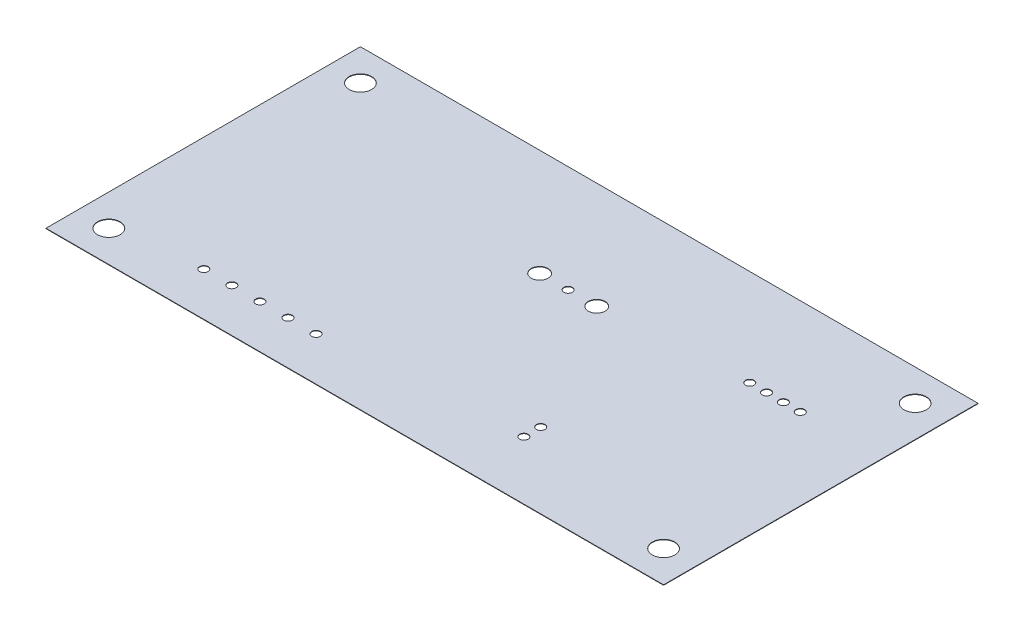
ISO-10303-21;
HEADER;
FILE_DESCRIPTION(('STEP AP214'),'2;1');
FILE_NAME('part.step','',(''),(''),'','','');
FILE_SCHEMA(('AUTOMOTIVE_DESIGN { 1 0 10303 214 1 1 1 1 }'));
ENDSEC;
DATA;
#1=APPLICATION_CONTEXT('core data for automotive mechanical design processes');
#2=APPLICATION_PROTOCOL_DEFINITION('international standard','automotive_design',2000,#1);
#3=PRODUCT_CONTEXT('',#1,'mechanical');
#4=PRODUCT('Part','Part','',(#3));
#5=PRODUCT_RELATED_PRODUCT_CATEGORY('part','',(#4));
#6=PRODUCT_DEFINITION_FORMATION('','',#4);
#7=PRODUCT_DEFINITION_CONTEXT('part definition',#1,'design');
#8=PRODUCT_DEFINITION('design','',#6,#7);
#9=PRODUCT_DEFINITION_SHAPE('','',#8);
#10=(LENGTH_UNIT() NAMED_UNIT(*) SI_UNIT(.MILLI.,.METRE.));
#11=(NAMED_UNIT(*) PLANE_ANGLE_UNIT() SI_UNIT($,.RADIAN.));
#12=(NAMED_UNIT(*) SI_UNIT($,.STERADIAN.) SOLID_ANGLE_UNIT());
#13=UNCERTAINTY_MEASURE_WITH_UNIT(LENGTH_MEASURE(1.E-05),#10,'distance_accuracy_value','');
#14=(GEOMETRIC_REPRESENTATION_CONTEXT(3) GLOBAL_UNCERTAINTY_ASSIGNED_CONTEXT((#13)) GLOBAL_UNIT_ASSIGNED_CONTEXT((#10,
#11,#12)) REPRESENTATION_CONTEXT('',''));
#15=CARTESIAN_POINT('',(0.,0.,0.));
#16=DIRECTION('',(0.,0.,1.));
#17=DIRECTION('',(1.,0.,0.));
#18=AXIS2_PLACEMENT_3D('',#15,#16,#17);
#19=CARTESIAN_POINT('',(0.,1.,0.));
#20=DIRECTION('',(0.,1.,0.));
#21=DIRECTION('',(0.,0.,1.));
#22=AXIS2_PLACEMENT_3D('',#19,#20,#21);
#23=PLANE('',#22);
#24=CARTESIAN_POINT('',(449.0212,1.,-98.4503999999998));
#25=DIRECTION('',(0.,1.,0.));
#26=DIRECTION('',(0.,0.,1.));
#27=AXIS2_PLACEMENT_3D('',#24,#25,#26);
#28=CIRCLE('',#27,9.67739999999995);
#29=CARTESIAN_POINT('',(449.0212,1.,-88.7729999999999));
#30=VERTEX_POINT('',#29);
#31=EDGE_CURVE('E205',#30,#30,#28,.T.);
#32=ORIENTED_EDGE('',*,*,#31,.F.);
#33=EDGE_LOOP('',(#32));
#34=FACE_BOUND('',#33,.T.);
#35=CARTESIAN_POINT('',(322.0212,1.,-98.4503999999998));
#36=DIRECTION('',(0.,1.,0.));
#37=DIRECTION('',(0.,0.,1.));
#38=AXIS2_PLACEMENT_3D('',#35,#36,#37);
#39=CIRCLE('',#38,9.6774);
#40=CARTESIAN_POINT('',(322.0212,1.,-88.7729999999998));
#41=VERTEX_POINT('',#40);
#42=EDGE_CURVE('E193',#41,#41,#39,.T.);
#43=ORIENTED_EDGE('',*,*,#42,.F.);
#44=EDGE_LOOP('',(#43));
#45=FACE_BOUND('',#44,.T.);
#46=CARTESIAN_POINT('',(775.716,1.,-469.9));
#47=DIRECTION('',(0.,1.,0.));
#48=DIRECTION('',(0.,0.,1.));
#49=AXIS2_PLACEMENT_3D('',#46,#47,#48);
#50=CIRCLE('',#49,19.05);
#51=CARTESIAN_POINT('',(775.716,1.,-450.85));
#52=VERTEX_POINT('',#51);
#53=EDGE_CURVE('E181',#52,#52,#50,.T.);
#54=ORIENTED_EDGE('',*,*,#53,.F.);
#55=EDGE_LOOP('',(#54));
#56=FACE_BOUND('',#55,.T.);
#57=CARTESIAN_POINT('',(1325.88,1.,-640.08));
#58=DIRECTION('',(0.,1.,0.));
#59=DIRECTION('',(0.,0.,1.));
#60=AXIS2_PLACEMENT_3D('',#57,#58,#59);
#61=CIRCLE('',#60,25.4000000000001);
#62=CARTESIAN_POINT('',(1325.88,1.,-614.68));
#63=VERTEX_POINT('',#62);
#64=EDGE_CURVE('E169',#63,#63,#61,.T.);
#65=ORIENTED_EDGE('',*,*,#64,.F.);
#66=EDGE_LOOP('',(#65));
#67=FACE_BOUND('',#66,.T.);
#68=CARTESIAN_POINT('',(71.1199999999999,1.,-71.1199999999998));
#69=DIRECTION('',(0.,1.,0.));
#70=DIRECTION('',(0.,0.,1.));
#71=AXIS2_PLACEMENT_3D('',#68,#69,#70);
#72=CIRCLE('',#71,25.4);
#73=CARTESIAN_POINT('',(71.1199999999999,1.,-45.7199999999998));
#74=VERTEX_POINT('',#73);
#75=EDGE_CURVE('E157',#74,#74,#72,.T.);
#76=ORIENTED_EDGE('',*,*,#75,.F.);
#77=EDGE_LOOP('',(#76));
#78=FACE_BOUND('',#77,.T.);
#79=CARTESIAN_POINT('',(711.2,1.,-469.9));
#80=DIRECTION('',(0.,1.,0.));
#81=DIRECTION('',(0.,0.,1.));
#82=AXIS2_PLACEMENT_3D('',#79,#80,#81);
#83=CIRCLE('',#82,9.67739999999995);
#84=CARTESIAN_POINT('',(711.2,1.,-460.2226));
#85=VERTEX_POINT('',#84);
#86=EDGE_CURVE('E145',#85,#85,#83,.T.);
#87=ORIENTED_EDGE('',*,*,#86,.F.);
#88=EDGE_LOOP('',(#87));
#89=FACE_BOUND('',#88,.T.);
#90=CARTESIAN_POINT('',(948.8424,1.,-170.2308));
#91=DIRECTION('',(0.,1.,0.));
#92=DIRECTION('',(0.,0.,1.));
#93=AXIS2_PLACEMENT_3D('',#90,#91,#92);
#94=CIRCLE('',#93,9.67739999999995);
#95=CARTESIAN_POINT('',(948.8424,1.,-160.5534));
#96=VERTEX_POINT('',#95);
#97=EDGE_CURVE('E133',#96,#96,#94,.T.);
#98=ORIENTED_EDGE('',*,*,#97,.F.);
#99=EDGE_LOOP('',(#98));
#100=FACE_BOUND('',#99,.T.);
#101=CARTESIAN_POINT('',(1174.8516,1.,-493.2172));
#102=DIRECTION('',(0.,1.,0.));
#103=DIRECTION('',(0.,0.,1.));
#104=AXIS2_PLACEMENT_3D('',#101,#102,#103);
#105=CIRCLE('',#104,9.67739999999995);
#106=CARTESIAN_POINT('',(1174.8516,1.,-483.5398));
#107=VERTEX_POINT('',#106);
#108=EDGE_CURVE('E121',#107,#107,#105,.T.);
#109=ORIENTED_EDGE('',*,*,#108,.F.);
#110=EDGE_LOOP('',(#109));
#111=FACE_BOUND('',#110,.T.);
#112=CARTESIAN_POINT('',(1098.6516,1.,-493.2172));
#113=DIRECTION('',(0.,1.,0.));
#114=DIRECTION('',(0.,0.,1.));
#115=AXIS2_PLACEMENT_3D('',#112,#113,#114);
#116=CIRCLE('',#115,9.67739999999995);
#117=CARTESIAN_POINT('',(1098.6516,1.,-483.5398));
#118=VERTEX_POINT('',#117);
#119=EDGE_CURVE('E100',#118,#118,#116,.T.);
#120=ORIENTED_EDGE('',*,*,#119,.F.);
#121=EDGE_LOOP('',(#120));
#122=FACE_BOUND('',#121,.T.);
#123=DIRECTION('',(0.,0.,-1.));
#124=VECTOR('',#123,1.);
#125=CARTESIAN_POINT('',(1397.,1.,1.11022302462516E-13));
#126=LINE('',#125,#124);
#127=CARTESIAN_POINT('',(1397.,1.,1.11022302462516E-13));
#128=VERTEX_POINT('',#127);
#129=CARTESIAN_POINT('',(1397.,1.,-711.2));
#130=VERTEX_POINT('',#129);
#131=EDGE_CURVE('E85',#128,#130,#126,.T.);
#132=ORIENTED_EDGE('',*,*,#131,.T.);
#133=DIRECTION('',(-1.,0.,0.));
#134=VECTOR('',#133,1.);
#135=CARTESIAN_POINT('',(1397.,1.,-711.2));
#136=LINE('',#135,#134);
#137=CARTESIAN_POINT('',(-1.04083408558608E-13,1.,-711.2));
#138=VERTEX_POINT('',#137);
#139=EDGE_CURVE('E80',#130,#138,#136,.T.);
#140=ORIENTED_EDGE('',*,*,#139,.T.);
#141=DIRECTION('',(0.,0.,1.));
#142=VECTOR('',#141,1.);
#143=CARTESIAN_POINT('',(-1.04083408558608E-13,1.,-711.2));
#144=LINE('',#143,#142);
#145=CARTESIAN_POINT('',(-1.04083408558608E-13,1.,1.11022302462516E-13));
#146=VERTEX_POINT('',#145);
#147=EDGE_CURVE('E83',#138,#146,#144,.T.);
#148=ORIENTED_EDGE('',*,*,#147,.T.);
#149=DIRECTION('',(1.,0.,0.));
#150=VECTOR('',#149,1.);
#151=CARTESIAN_POINT('',(-1.04083408558608E-13,1.,1.11022302462516E-13));
#152=LINE('',#151,#150);
#153=EDGE_CURVE('E50',#146,#128,#152,.T.);
#154=ORIENTED_EDGE('',*,*,#153,.T.);
#155=EDGE_LOOP('',(#132,#140,#148,#154));
#156=FACE_BOUND('',#155,.T.);
#157=CARTESIAN_POINT('',(1136.7516,1.,-493.2172));
#158=DIRECTION('',(0.,1.,0.));
#159=DIRECTION('',(0.,0.,1.));
#160=AXIS2_PLACEMENT_3D('',#157,#158,#159);
#161=CIRCLE('',#160,9.67739999999995);
#162=CARTESIAN_POINT('',(1136.7516,1.,-483.5398));
#163=VERTEX_POINT('',#162);
#164=EDGE_CURVE('E115',#163,#163,#161,.T.);
#165=ORIENTED_EDGE('',*,*,#164,.F.);
#166=EDGE_LOOP('',(#165));
#167=FACE_BOUND('',#166,.T.);
#168=CARTESIAN_POINT('',(1212.9516,1.,-493.2172));
#169=DIRECTION('',(0.,1.,0.));
#170=DIRECTION('',(0.,0.,1.));
#171=AXIS2_PLACEMENT_3D('',#168,#169,#170);
#172=CIRCLE('',#171,9.67739999999995);
#173=CARTESIAN_POINT('',(1212.9516,1.,-483.5398));
#174=VERTEX_POINT('',#173);
#175=EDGE_CURVE('E127',#174,#174,#172,.T.);
#176=ORIENTED_EDGE('',*,*,#175,.F.);
#177=EDGE_LOOP('',(#176));
#178=FACE_BOUND('',#177,.T.);
#179=CARTESIAN_POINT('',(948.8424,1.,-132.1308));
#180=DIRECTION('',(0.,1.,0.));
#181=DIRECTION('',(0.,0.,1.));
#182=AXIS2_PLACEMENT_3D('',#179,#180,#181);
#183=CIRCLE('',#182,9.67739999999995);
#184=CARTESIAN_POINT('',(948.8424,1.,-122.4534));
#185=VERTEX_POINT('',#184);
#186=EDGE_CURVE('E139',#185,#185,#183,.T.);
#187=ORIENTED_EDGE('',*,*,#186,.F.);
#188=EDGE_LOOP('',(#187));
#189=FACE_BOUND('',#188,.T.);
#190=CARTESIAN_POINT('',(71.1199999999999,1.,-640.08));
#191=DIRECTION('',(0.,1.,0.));
#192=DIRECTION('',(0.,0.,1.));
#193=AXIS2_PLACEMENT_3D('',#190,#191,#192);
#194=CIRCLE('',#193,25.4);
#195=CARTESIAN_POINT('',(71.1199999999999,1.,-614.68));
#196=VERTEX_POINT('',#195);
#197=EDGE_CURVE('E151',#196,#196,#194,.T.);
#198=ORIENTED_EDGE('',*,*,#197,.F.);
#199=EDGE_LOOP('',(#198));
#200=FACE_BOUND('',#199,.T.);
#201=CARTESIAN_POINT('',(1325.88,1.,-71.1199999999998));
#202=DIRECTION('',(0.,1.,0.));
#203=DIRECTION('',(0.,0.,1.));
#204=AXIS2_PLACEMENT_3D('',#201,#202,#203);
#205=CIRCLE('',#204,25.4000000000001);
#206=CARTESIAN_POINT('',(1325.88,1.,-45.7199999999998));
#207=VERTEX_POINT('',#206);
#208=EDGE_CURVE('E163',#207,#207,#205,.T.);
#209=ORIENTED_EDGE('',*,*,#208,.F.);
#210=EDGE_LOOP('',(#209));
#211=FACE_BOUND('',#210,.T.);
#212=CARTESIAN_POINT('',(646.684,1.,-469.9));
#213=DIRECTION('',(0.,1.,0.));
#214=DIRECTION('',(0.,0.,1.));
#215=AXIS2_PLACEMENT_3D('',#212,#213,#214);
#216=CIRCLE('',#215,19.05);
#217=CARTESIAN_POINT('',(646.684,1.,-450.85));
#218=VERTEX_POINT('',#217);
#219=EDGE_CURVE('E175',#218,#218,#216,.T.);
#220=ORIENTED_EDGE('',*,*,#219,.F.);
#221=EDGE_LOOP('',(#220));
#222=FACE_BOUND('',#221,.T.);
#223=CARTESIAN_POINT('',(258.5212,1.,-98.4503999999998));
#224=DIRECTION('',(0.,1.,0.));
#225=DIRECTION('',(0.,0.,1.));
#226=AXIS2_PLACEMENT_3D('',#223,#224,#225);
#227=CIRCLE('',#226,9.6774);
#228=CARTESIAN_POINT('',(258.5212,1.,-88.7729999999998));
#229=VERTEX_POINT('',#228);
#230=EDGE_CURVE('E187',#229,#229,#227,.T.);
#231=ORIENTED_EDGE('',*,*,#230,.F.);
#232=EDGE_LOOP('',(#231));
#233=FACE_BOUND('',#232,.T.);
#234=CARTESIAN_POINT('',(385.5212,1.,-98.4503999999998));
#235=DIRECTION('',(0.,1.,0.));
#236=DIRECTION('',(0.,0.,1.));
#237=AXIS2_PLACEMENT_3D('',#234,#235,#236);
#238=CIRCLE('',#237,9.6774);
#239=CARTESIAN_POINT('',(385.5212,1.,-88.7729999999998));
#240=VERTEX_POINT('',#239);
#241=EDGE_CURVE('E199',#240,#240,#238,.T.);
#242=ORIENTED_EDGE('',*,*,#241,.F.);
#243=EDGE_LOOP('',(#242));
#244=FACE_BOUND('',#243,.T.);
#245=CARTESIAN_POINT('',(512.5212,1.,-98.4503999999998));
#246=DIRECTION('',(0.,1.,0.));
#247=DIRECTION('',(0.,0.,1.));
#248=AXIS2_PLACEMENT_3D('',#245,#246,#247);
#249=CIRCLE('',#248,9.67739999999995);
#250=CARTESIAN_POINT('',(512.5212,1.,-88.7729999999999));
#251=VERTEX_POINT('',#250);
#252=EDGE_CURVE('E211',#251,#251,#249,.T.);
#253=ORIENTED_EDGE('',*,*,#252,.F.);
#254=EDGE_LOOP('',(#253));
#255=FACE_BOUND('',#254,.T.);
#256=ADVANCED_FACE('F33',(#34,#45,#56,#67,#78,#89,#100,#111,#122,#156,#167,#178,#189,#200,#211,
#222,#233,#244,#255),#23,.T.);
#257=CARTESIAN_POINT('',(0.,0.,0.));
#258=DIRECTION('',(0.,1.,0.));
#259=DIRECTION('',(0.,0.,1.));
#260=AXIS2_PLACEMENT_3D('',#257,#258,#259);
#261=PLANE('',#260);
#262=DIRECTION('',(0.,0.,-1.));
#263=VECTOR('',#262,1.);
#264=CARTESIAN_POINT('',(1397.,0.,1.11022302462516E-13));
#265=LINE('',#264,#263);
#266=CARTESIAN_POINT('',(1397.,0.,1.11022302462516E-13));
#267=VERTEX_POINT('',#266);
#268=CARTESIAN_POINT('',(1397.,0.,-711.2));
#269=VERTEX_POINT('',#268);
#270=EDGE_CURVE('E97',#267,#269,#265,.T.);
#271=ORIENTED_EDGE('',*,*,#270,.F.);
#272=DIRECTION('',(1.,0.,0.));
#273=VECTOR('',#272,1.);
#274=CARTESIAN_POINT('',(-1.04083408558608E-13,0.,1.11022302462516E-13));
#275=LINE('',#274,#273);
#276=CARTESIAN_POINT('',(-1.04083408558608E-13,0.,1.11022302462516E-13));
#277=VERTEX_POINT('',#276);
#278=EDGE_CURVE('E73',#277,#267,#275,.T.);
#279=ORIENTED_EDGE('',*,*,#278,.F.);
#280=DIRECTION('',(0.,0.,1.));
#281=VECTOR('',#280,1.);
#282=CARTESIAN_POINT('',(-1.04083408558608E-13,0.,-711.2));
#283=LINE('',#282,#281);
#284=CARTESIAN_POINT('',(-1.04083408558608E-13,0.,-711.2));
#285=VERTEX_POINT('',#284);
#286=EDGE_CURVE('E67',#285,#277,#283,.T.);
#287=ORIENTED_EDGE('',*,*,#286,.F.);
#288=DIRECTION('',(-1.,0.,0.));
#289=VECTOR('',#288,1.);
#290=CARTESIAN_POINT('',(1397.,0.,-711.2));
#291=LINE('',#290,#289);
#292=EDGE_CURVE('E89',#269,#285,#291,.T.);
#293=ORIENTED_EDGE('',*,*,#292,.F.);
#294=EDGE_LOOP('',(#271,#279,#287,#293));
#295=FACE_BOUND('',#294,.T.);
#296=CARTESIAN_POINT('',(1098.6516,0.,-493.2172));
#297=DIRECTION('',(0.,1.,0.));
#298=DIRECTION('',(0.,0.,1.));
#299=AXIS2_PLACEMENT_3D('',#296,#297,#298);
#300=CIRCLE('',#299,9.67739999999995);
#301=CARTESIAN_POINT('',(1098.6516,0.,-483.5398));
#302=VERTEX_POINT('',#301);
#303=EDGE_CURVE('E112',#302,#302,#300,.T.);
#304=ORIENTED_EDGE('',*,*,#303,.T.);
#305=EDGE_LOOP('',(#304));
#306=FACE_BOUND('',#305,.T.);
#307=CARTESIAN_POINT('',(1136.7516,0.,-493.2172));
#308=DIRECTION('',(0.,1.,0.));
#309=DIRECTION('',(0.,0.,1.));
#310=AXIS2_PLACEMENT_3D('',#307,#308,#309);
#311=CIRCLE('',#310,9.67739999999995);
#312=CARTESIAN_POINT('',(1136.7516,0.,-483.5398));
#313=VERTEX_POINT('',#312);
#314=EDGE_CURVE('E118',#313,#313,#311,.T.);
#315=ORIENTED_EDGE('',*,*,#314,.T.);
#316=EDGE_LOOP('',(#315));
#317=FACE_BOUND('',#316,.T.);
#318=CARTESIAN_POINT('',(1174.8516,0.,-493.2172));
#319=DIRECTION('',(0.,1.,0.));
#320=DIRECTION('',(0.,0.,1.));
#321=AXIS2_PLACEMENT_3D('',#318,#319,#320);
#322=CIRCLE('',#321,9.67739999999995);
#323=CARTESIAN_POINT('',(1174.8516,0.,-483.5398));
#324=VERTEX_POINT('',#323);
#325=EDGE_CURVE('E124',#324,#324,#322,.T.);
#326=ORIENTED_EDGE('',*,*,#325,.T.);
#327=EDGE_LOOP('',(#326));
#328=FACE_BOUND('',#327,.T.);
#329=CARTESIAN_POINT('',(1212.9516,0.,-493.2172));
#330=DIRECTION('',(0.,1.,0.));
#331=DIRECTION('',(0.,0.,1.));
#332=AXIS2_PLACEMENT_3D('',#329,#330,#331);
#333=CIRCLE('',#332,9.67739999999995);
#334=CARTESIAN_POINT('',(1212.9516,0.,-483.5398));
#335=VERTEX_POINT('',#334);
#336=EDGE_CURVE('E130',#335,#335,#333,.T.);
#337=ORIENTED_EDGE('',*,*,#336,.T.);
#338=EDGE_LOOP('',(#337));
#339=FACE_BOUND('',#338,.T.);
#340=CARTESIAN_POINT('',(948.8424,0.,-170.2308));
#341=DIRECTION('',(0.,1.,0.));
#342=DIRECTION('',(0.,0.,1.));
#343=AXIS2_PLACEMENT_3D('',#340,#341,#342);
#344=CIRCLE('',#343,9.67739999999995);
#345=CARTESIAN_POINT('',(948.8424,0.,-160.5534));
#346=VERTEX_POINT('',#345);
#347=EDGE_CURVE('E136',#346,#346,#344,.T.);
#348=ORIENTED_EDGE('',*,*,#347,.T.);
#349=EDGE_LOOP('',(#348));
#350=FACE_BOUND('',#349,.T.);
#351=CARTESIAN_POINT('',(948.8424,0.,-132.1308));
#352=DIRECTION('',(0.,1.,0.));
#353=DIRECTION('',(0.,0.,1.));
#354=AXIS2_PLACEMENT_3D('',#351,#352,#353);
#355=CIRCLE('',#354,9.67739999999995);
#356=CARTESIAN_POINT('',(948.8424,0.,-122.4534));
#357=VERTEX_POINT('',#356);
#358=EDGE_CURVE('E142',#357,#357,#355,.T.);
#359=ORIENTED_EDGE('',*,*,#358,.T.);
#360=EDGE_LOOP('',(#359));
#361=FACE_BOUND('',#360,.T.);
#362=CARTESIAN_POINT('',(711.2,0.,-469.9));
#363=DIRECTION('',(0.,1.,0.));
#364=DIRECTION('',(0.,0.,1.));
#365=AXIS2_PLACEMENT_3D('',#362,#363,#364);
#366=CIRCLE('',#365,9.67739999999995);
#367=CARTESIAN_POINT('',(711.2,0.,-460.2226));
#368=VERTEX_POINT('',#367);
#369=EDGE_CURVE('E148',#368,#368,#366,.T.);
#370=ORIENTED_EDGE('',*,*,#369,.T.);
#371=EDGE_LOOP('',(#370));
#372=FACE_BOUND('',#371,.T.);
#373=CARTESIAN_POINT('',(71.1199999999999,0.,-640.08));
#374=DIRECTION('',(0.,1.,0.));
#375=DIRECTION('',(0.,0.,1.));
#376=AXIS2_PLACEMENT_3D('',#373,#374,#375);
#377=CIRCLE('',#376,25.4);
#378=CARTESIAN_POINT('',(71.1199999999999,0.,-614.68));
#379=VERTEX_POINT('',#378);
#380=EDGE_CURVE('E154',#379,#379,#377,.T.);
#381=ORIENTED_EDGE('',*,*,#380,.T.);
#382=EDGE_LOOP('',(#381));
#383=FACE_BOUND('',#382,.T.);
#384=CARTESIAN_POINT('',(71.1199999999999,0.,-71.1199999999998));
#385=DIRECTION('',(0.,1.,0.));
#386=DIRECTION('',(0.,0.,1.));
#387=AXIS2_PLACEMENT_3D('',#384,#385,#386);
#388=CIRCLE('',#387,25.4);
#389=CARTESIAN_POINT('',(71.1199999999999,0.,-45.7199999999998));
#390=VERTEX_POINT('',#389);
#391=EDGE_CURVE('E160',#390,#390,#388,.T.);
#392=ORIENTED_EDGE('',*,*,#391,.T.);
#393=EDGE_LOOP('',(#392));
#394=FACE_BOUND('',#393,.T.);
#395=CARTESIAN_POINT('',(1325.88,0.,-71.1199999999998));
#396=DIRECTION('',(0.,1.,0.));
#397=DIRECTION('',(0.,0.,1.));
#398=AXIS2_PLACEMENT_3D('',#395,#396,#397);
#399=CIRCLE('',#398,25.4000000000001);
#400=CARTESIAN_POINT('',(1325.88,0.,-45.7199999999998));
#401=VERTEX_POINT('',#400);
#402=EDGE_CURVE('E166',#401,#401,#399,.T.);
#403=ORIENTED_EDGE('',*,*,#402,.T.);
#404=EDGE_LOOP('',(#403));
#405=FACE_BOUND('',#404,.T.);
#406=CARTESIAN_POINT('',(1325.88,0.,-640.08));
#407=DIRECTION('',(0.,1.,0.));
#408=DIRECTION('',(0.,0.,1.));
#409=AXIS2_PLACEMENT_3D('',#406,#407,#408);
#410=CIRCLE('',#409,25.4000000000001);
#411=CARTESIAN_POINT('',(1325.88,0.,-614.68));
#412=VERTEX_POINT('',#411);
#413=EDGE_CURVE('E172',#412,#412,#410,.T.);
#414=ORIENTED_EDGE('',*,*,#413,.T.);
#415=EDGE_LOOP('',(#414));
#416=FACE_BOUND('',#415,.T.);
#417=CARTESIAN_POINT('',(646.684,0.,-469.9));
#418=DIRECTION('',(0.,1.,0.));
#419=DIRECTION('',(0.,0.,1.));
#420=AXIS2_PLACEMENT_3D('',#417,#418,#419);
#421=CIRCLE('',#420,19.05);
#422=CARTESIAN_POINT('',(646.684,0.,-450.85));
#423=VERTEX_POINT('',#422);
#424=EDGE_CURVE('E178',#423,#423,#421,.T.);
#425=ORIENTED_EDGE('',*,*,#424,.T.);
#426=EDGE_LOOP('',(#425));
#427=FACE_BOUND('',#426,.T.);
#428=CARTESIAN_POINT('',(775.716,0.,-469.9));
#429=DIRECTION('',(0.,1.,0.));
#430=DIRECTION('',(0.,0.,1.));
#431=AXIS2_PLACEMENT_3D('',#428,#429,#430);
#432=CIRCLE('',#431,19.05);
#433=CARTESIAN_POINT('',(775.716,0.,-450.85));
#434=VERTEX_POINT('',#433);
#435=EDGE_CURVE('E184',#434,#434,#432,.T.);
#436=ORIENTED_EDGE('',*,*,#435,.T.);
#437=EDGE_LOOP('',(#436));
#438=FACE_BOUND('',#437,.T.);
#439=CARTESIAN_POINT('',(258.5212,0.,-98.4503999999998));
#440=DIRECTION('',(0.,1.,0.));
#441=DIRECTION('',(0.,0.,1.));
#442=AXIS2_PLACEMENT_3D('',#439,#440,#441);
#443=CIRCLE('',#442,9.6774);
#444=CARTESIAN_POINT('',(258.5212,0.,-88.7729999999998));
#445=VERTEX_POINT('',#444);
#446=EDGE_CURVE('E190',#445,#445,#443,.T.);
#447=ORIENTED_EDGE('',*,*,#446,.T.);
#448=EDGE_LOOP('',(#447));
#449=FACE_BOUND('',#448,.T.);
#450=CARTESIAN_POINT('',(322.0212,0.,-98.4503999999998));
#451=DIRECTION('',(0.,1.,0.));
#452=DIRECTION('',(0.,0.,1.));
#453=AXIS2_PLACEMENT_3D('',#450,#451,#452);
#454=CIRCLE('',#453,9.6774);
#455=CARTESIAN_POINT('',(322.0212,0.,-88.7729999999998));
#456=VERTEX_POINT('',#455);
#457=EDGE_CURVE('E196',#456,#456,#454,.T.);
#458=ORIENTED_EDGE('',*,*,#457,.T.);
#459=EDGE_LOOP('',(#458));
#460=FACE_BOUND('',#459,.T.);
#461=CARTESIAN_POINT('',(385.5212,0.,-98.4503999999998));
#462=DIRECTION('',(0.,1.,0.));
#463=DIRECTION('',(0.,0.,1.));
#464=AXIS2_PLACEMENT_3D('',#461,#462,#463);
#465=CIRCLE('',#464,9.6774);
#466=CARTESIAN_POINT('',(385.5212,0.,-88.7729999999998));
#467=VERTEX_POINT('',#466);
#468=EDGE_CURVE('E202',#467,#467,#465,.T.);
#469=ORIENTED_EDGE('',*,*,#468,.T.);
#470=EDGE_LOOP('',(#469));
#471=FACE_BOUND('',#470,.T.);
#472=CARTESIAN_POINT('',(449.0212,0.,-98.4503999999998));
#473=DIRECTION('',(0.,1.,0.));
#474=DIRECTION('',(0.,0.,1.));
#475=AXIS2_PLACEMENT_3D('',#472,#473,#474);
#476=CIRCLE('',#475,9.67739999999995);
#477=CARTESIAN_POINT('',(449.0212,0.,-88.7729999999999));
#478=VERTEX_POINT('',#477);
#479=EDGE_CURVE('E208',#478,#478,#476,.T.);
#480=ORIENTED_EDGE('',*,*,#479,.T.);
#481=EDGE_LOOP('',(#480));
#482=FACE_BOUND('',#481,.T.);
#483=CARTESIAN_POINT('',(512.5212,0.,-98.4503999999998));
#484=DIRECTION('',(0.,1.,0.));
#485=DIRECTION('',(0.,0.,1.));
#486=AXIS2_PLACEMENT_3D('',#483,#484,#485);
#487=CIRCLE('',#486,9.67739999999995);
#488=CARTESIAN_POINT('',(512.5212,0.,-88.7729999999999));
#489=VERTEX_POINT('',#488);
#490=EDGE_CURVE('E214',#489,#489,#487,.T.);
#491=ORIENTED_EDGE('',*,*,#490,.T.);
#492=EDGE_LOOP('',(#491));
#493=FACE_BOUND('',#492,.T.);
#494=ADVANCED_FACE('F108',(#295,#306,#317,#328,#339,#350,#361,#372,#383,#394,#405,#416,#427,
#438,#449,#460,#471,#482,#493),#261,.F.);
#495=CARTESIAN_POINT('',(1397.,1.,1.11022302462516E-13));
#496=DIRECTION('',(-1.,0.,0.));
#497=DIRECTION('',(0.,0.,1.));
#498=AXIS2_PLACEMENT_3D('',#495,#496,#497);
#499=PLANE('',#498);
#500=ORIENTED_EDGE('',*,*,#270,.T.);
#501=DIRECTION('',(0.,-1.,0.));
#502=VECTOR('',#501,1.);
#503=CARTESIAN_POINT('',(1397.,1.,-711.2));
#504=LINE('',#503,#502);
#505=EDGE_CURVE('E11',#130,#269,#504,.T.);
#506=ORIENTED_EDGE('',*,*,#505,.F.);
#507=ORIENTED_EDGE('',*,*,#131,.F.);
#508=DIRECTION('',(0.,-1.,0.));
#509=VECTOR('',#508,1.);
#510=CARTESIAN_POINT('',(1397.,1.,1.11022302462516E-13));
#511=LINE('',#510,#509);
#512=EDGE_CURVE('E93',#128,#267,#511,.T.);
#513=ORIENTED_EDGE('',*,*,#512,.T.);
#514=EDGE_LOOP('',(#500,#506,#507,#513));
#515=FACE_BOUND('',#514,.T.);
#516=ADVANCED_FACE('F35',(#515),#499,.F.);
#517=CARTESIAN_POINT('',(1397.,1.,-711.2));
#518=DIRECTION('',(0.,0.,1.));
#519=DIRECTION('',(1.,0.,0.));
#520=AXIS2_PLACEMENT_3D('',#517,#518,#519);
#521=PLANE('',#520);
#522=ORIENTED_EDGE('',*,*,#292,.T.);
#523=DIRECTION('',(0.,-1.,0.));
#524=VECTOR('',#523,1.);
#525=CARTESIAN_POINT('',(-1.04083408558608E-13,1.,-711.2));
#526=LINE('',#525,#524);
#527=EDGE_CURVE('E42',#138,#285,#526,.T.);
#528=ORIENTED_EDGE('',*,*,#527,.F.);
#529=ORIENTED_EDGE('',*,*,#139,.F.);
#530=ORIENTED_EDGE('',*,*,#505,.T.);
#531=EDGE_LOOP('',(#522,#528,#529,#530));
#532=FACE_BOUND('',#531,.T.);
#533=ADVANCED_FACE('F88',(#532),#521,.F.);
#534=CARTESIAN_POINT('',(-1.04083408558608E-13,1.,-711.2));
#535=DIRECTION('',(1.,0.,0.));
#536=DIRECTION('',(0.,0.,-1.));
#537=AXIS2_PLACEMENT_3D('',#534,#535,#536);
#538=PLANE('',#537);
#539=ORIENTED_EDGE('',*,*,#286,.T.);
#540=DIRECTION('',(0.,-1.,0.));
#541=VECTOR('',#540,1.);
#542=CARTESIAN_POINT('',(-1.04083408558608E-13,1.,1.11022302462516E-13));
#543=LINE('',#542,#541);
#544=EDGE_CURVE('E90',#146,#277,#543,.T.);
#545=ORIENTED_EDGE('',*,*,#544,.F.);
#546=ORIENTED_EDGE('',*,*,#147,.F.);
#547=ORIENTED_EDGE('',*,*,#527,.T.);
#548=EDGE_LOOP('',(#539,#545,#546,#547));
#549=FACE_BOUND('',#548,.T.);
#550=ADVANCED_FACE('F91',(#549),#538,.F.);
#551=CARTESIAN_POINT('',(-1.04083408558608E-13,1.,1.11022302462516E-13));
#552=DIRECTION('',(0.,0.,-1.));
#553=DIRECTION('',(-1.,0.,0.));
#554=AXIS2_PLACEMENT_3D('',#551,#552,#553);
#555=PLANE('',#554);
#556=ORIENTED_EDGE('',*,*,#278,.T.);
#557=ORIENTED_EDGE('',*,*,#512,.F.);
#558=ORIENTED_EDGE('',*,*,#153,.F.);
#559=ORIENTED_EDGE('',*,*,#544,.T.);
#560=EDGE_LOOP('',(#556,#557,#558,#559));
#561=FACE_BOUND('',#560,.T.);
#562=ADVANCED_FACE('F105',(#561),#555,.F.);
#563=CARTESIAN_POINT('',(1098.6516,1.,-493.2172));
#564=DIRECTION('',(0.,-1.,0.));
#565=DIRECTION('',(0.,0.,-1.));
#566=AXIS2_PLACEMENT_3D('',#563,#564,#565);
#567=CYLINDRICAL_SURFACE('',#566,9.67739999999995);
#568=ORIENTED_EDGE('',*,*,#119,.T.);
#569=EDGE_LOOP('',(#568));
#570=FACE_BOUND('',#569,.T.);
#571=ORIENTED_EDGE('',*,*,#303,.F.);
#572=EDGE_LOOP('',(#571));
#573=FACE_BOUND('',#572,.T.);
#574=ADVANCED_FACE('F233',(#570,#573),#567,.F.);
#575=CARTESIAN_POINT('',(1136.7516,1.,-493.2172));
#576=DIRECTION('',(0.,-1.,0.));
#577=DIRECTION('',(0.,0.,-1.));
#578=AXIS2_PLACEMENT_3D('',#575,#576,#577);
#579=CYLINDRICAL_SURFACE('',#578,9.67739999999995);
#580=ORIENTED_EDGE('',*,*,#164,.T.);
#581=EDGE_LOOP('',(#580));
#582=FACE_BOUND('',#581,.T.);
#583=ORIENTED_EDGE('',*,*,#314,.F.);
#584=EDGE_LOOP('',(#583));
#585=FACE_BOUND('',#584,.T.);
#586=ADVANCED_FACE('F279',(#582,#585),#579,.F.);
#587=CARTESIAN_POINT('',(1174.8516,1.,-493.2172));
#588=DIRECTION('',(0.,-1.,0.));
#589=DIRECTION('',(0.,0.,-1.));
#590=AXIS2_PLACEMENT_3D('',#587,#588,#589);
#591=CYLINDRICAL_SURFACE('',#590,9.67739999999995);
#592=ORIENTED_EDGE('',*,*,#108,.T.);
#593=EDGE_LOOP('',(#592));
#594=FACE_BOUND('',#593,.T.);
#595=ORIENTED_EDGE('',*,*,#325,.F.);
#596=EDGE_LOOP('',(#595));
#597=FACE_BOUND('',#596,.T.);
#598=ADVANCED_FACE('F287',(#594,#597),#591,.F.);
#599=CARTESIAN_POINT('',(1212.9516,1.,-493.2172));
#600=DIRECTION('',(0.,-1.,0.));
#601=DIRECTION('',(0.,0.,-1.));
#602=AXIS2_PLACEMENT_3D('',#599,#600,#601);
#603=CYLINDRICAL_SURFACE('',#602,9.67739999999995);
#604=ORIENTED_EDGE('',*,*,#175,.T.);
#605=EDGE_LOOP('',(#604));
#606=FACE_BOUND('',#605,.T.);
#607=ORIENTED_EDGE('',*,*,#336,.F.);
#608=EDGE_LOOP('',(#607));
#609=FACE_BOUND('',#608,.T.);
#610=ADVANCED_FACE('F295',(#606,#609),#603,.F.);
#611=CARTESIAN_POINT('',(948.8424,1.,-170.2308));
#612=DIRECTION('',(0.,-1.,0.));
#613=DIRECTION('',(0.,0.,-1.));
#614=AXIS2_PLACEMENT_3D('',#611,#612,#613);
#615=CYLINDRICAL_SURFACE('',#614,9.67739999999995);
#616=ORIENTED_EDGE('',*,*,#97,.T.);
#617=EDGE_LOOP('',(#616));
#618=FACE_BOUND('',#617,.T.);
#619=ORIENTED_EDGE('',*,*,#347,.F.);
#620=EDGE_LOOP('',(#619));
#621=FACE_BOUND('',#620,.T.);
#622=ADVANCED_FACE('F304',(#618,#621),#615,.F.);
#623=CARTESIAN_POINT('',(948.8424,1.,-132.1308));
#624=DIRECTION('',(0.,-1.,0.));
#625=DIRECTION('',(0.,0.,-1.));
#626=AXIS2_PLACEMENT_3D('',#623,#624,#625);
#627=CYLINDRICAL_SURFACE('',#626,9.67739999999995);
#628=ORIENTED_EDGE('',*,*,#186,.T.);
#629=EDGE_LOOP('',(#628));
#630=FACE_BOUND('',#629,.T.);
#631=ORIENTED_EDGE('',*,*,#358,.F.);
#632=EDGE_LOOP('',(#631));
#633=FACE_BOUND('',#632,.T.);
#634=ADVANCED_FACE('F313',(#630,#633),#627,.F.);
#635=CARTESIAN_POINT('',(711.2,1.,-469.9));
#636=DIRECTION('',(0.,-1.,0.));
#637=DIRECTION('',(0.,0.,-1.));
#638=AXIS2_PLACEMENT_3D('',#635,#636,#637);
#639=CYLINDRICAL_SURFACE('',#638,9.67739999999995);
#640=ORIENTED_EDGE('',*,*,#86,.T.);
#641=EDGE_LOOP('',(#640));
#642=FACE_BOUND('',#641,.T.);
#643=ORIENTED_EDGE('',*,*,#369,.F.);
#644=EDGE_LOOP('',(#643));
#645=FACE_BOUND('',#644,.T.);
#646=ADVANCED_FACE('F322',(#642,#645),#639,.F.);
#647=CARTESIAN_POINT('',(71.1199999999999,1.,-640.08));
#648=DIRECTION('',(0.,-1.,0.));
#649=DIRECTION('',(0.,0.,-1.));
#650=AXIS2_PLACEMENT_3D('',#647,#648,#649);
#651=CYLINDRICAL_SURFACE('',#650,25.4);
#652=ORIENTED_EDGE('',*,*,#197,.T.);
#653=EDGE_LOOP('',(#652));
#654=FACE_BOUND('',#653,.T.);
#655=ORIENTED_EDGE('',*,*,#380,.F.);
#656=EDGE_LOOP('',(#655));
#657=FACE_BOUND('',#656,.T.);
#658=ADVANCED_FACE('F331',(#654,#657),#651,.F.);
#659=CARTESIAN_POINT('',(71.1199999999999,1.,-71.1199999999998));
#660=DIRECTION('',(0.,-1.,0.));
#661=DIRECTION('',(0.,0.,-1.));
#662=AXIS2_PLACEMENT_3D('',#659,#660,#661);
#663=CYLINDRICAL_SURFACE('',#662,25.4);
#664=ORIENTED_EDGE('',*,*,#75,.T.);
#665=EDGE_LOOP('',(#664));
#666=FACE_BOUND('',#665,.T.);
#667=ORIENTED_EDGE('',*,*,#391,.F.);
#668=EDGE_LOOP('',(#667));
#669=FACE_BOUND('',#668,.T.);
#670=ADVANCED_FACE('F340',(#666,#669),#663,.F.);
#671=CARTESIAN_POINT('',(1325.88,1.,-71.1199999999998));
#672=DIRECTION('',(0.,-1.,0.));
#673=DIRECTION('',(0.,0.,-1.));
#674=AXIS2_PLACEMENT_3D('',#671,#672,#673);
#675=CYLINDRICAL_SURFACE('',#674,25.4000000000001);
#676=ORIENTED_EDGE('',*,*,#208,.T.);
#677=EDGE_LOOP('',(#676));
#678=FACE_BOUND('',#677,.T.);
#679=ORIENTED_EDGE('',*,*,#402,.F.);
#680=EDGE_LOOP('',(#679));
#681=FACE_BOUND('',#680,.T.);
#682=ADVANCED_FACE('F349',(#678,#681),#675,.F.);
#683=CARTESIAN_POINT('',(1325.88,1.,-640.08));
#684=DIRECTION('',(0.,-1.,0.));
#685=DIRECTION('',(0.,0.,-1.));
#686=AXIS2_PLACEMENT_3D('',#683,#684,#685);
#687=CYLINDRICAL_SURFACE('',#686,25.4000000000001);
#688=ORIENTED_EDGE('',*,*,#64,.T.);
#689=EDGE_LOOP('',(#688));
#690=FACE_BOUND('',#689,.T.);
#691=ORIENTED_EDGE('',*,*,#413,.F.);
#692=EDGE_LOOP('',(#691));
#693=FACE_BOUND('',#692,.T.);
#694=ADVANCED_FACE('F358',(#690,#693),#687,.F.);
#695=CARTESIAN_POINT('',(646.684,1.,-469.9));
#696=DIRECTION('',(0.,-1.,0.));
#697=DIRECTION('',(0.,0.,-1.));
#698=AXIS2_PLACEMENT_3D('',#695,#696,#697);
#699=CYLINDRICAL_SURFACE('',#698,19.05);
#700=ORIENTED_EDGE('',*,*,#219,.T.);
#701=EDGE_LOOP('',(#700));
#702=FACE_BOUND('',#701,.T.);
#703=ORIENTED_EDGE('',*,*,#424,.F.);
#704=EDGE_LOOP('',(#703));
#705=FACE_BOUND('',#704,.T.);
#706=ADVANCED_FACE('F367',(#702,#705),#699,.F.);
#707=CARTESIAN_POINT('',(775.716,1.,-469.9));
#708=DIRECTION('',(0.,-1.,0.));
#709=DIRECTION('',(0.,0.,-1.));
#710=AXIS2_PLACEMENT_3D('',#707,#708,#709);
#711=CYLINDRICAL_SURFACE('',#710,19.05);
#712=ORIENTED_EDGE('',*,*,#53,.T.);
#713=EDGE_LOOP('',(#712));
#714=FACE_BOUND('',#713,.T.);
#715=ORIENTED_EDGE('',*,*,#435,.F.);
#716=EDGE_LOOP('',(#715));
#717=FACE_BOUND('',#716,.T.);
#718=ADVANCED_FACE('F376',(#714,#717),#711,.F.);
#719=CARTESIAN_POINT('',(258.5212,1.,-98.4503999999998));
#720=DIRECTION('',(0.,-1.,0.));
#721=DIRECTION('',(0.,0.,-1.));
#722=AXIS2_PLACEMENT_3D('',#719,#720,#721);
#723=CYLINDRICAL_SURFACE('',#722,9.6774);
#724=ORIENTED_EDGE('',*,*,#230,.T.);
#725=EDGE_LOOP('',(#724));
#726=FACE_BOUND('',#725,.T.);
#727=ORIENTED_EDGE('',*,*,#446,.F.);
#728=EDGE_LOOP('',(#727));
#729=FACE_BOUND('',#728,.T.);
#730=ADVANCED_FACE('F385',(#726,#729),#723,.F.);
#731=CARTESIAN_POINT('',(322.0212,1.,-98.4503999999998));
#732=DIRECTION('',(0.,-1.,0.));
#733=DIRECTION('',(0.,0.,-1.));
#734=AXIS2_PLACEMENT_3D('',#731,#732,#733);
#735=CYLINDRICAL_SURFACE('',#734,9.6774);
#736=ORIENTED_EDGE('',*,*,#42,.T.);
#737=EDGE_LOOP('',(#736));
#738=FACE_BOUND('',#737,.T.);
#739=ORIENTED_EDGE('',*,*,#457,.F.);
#740=EDGE_LOOP('',(#739));
#741=FACE_BOUND('',#740,.T.);
#742=ADVANCED_FACE('F394',(#738,#741),#735,.F.);
#743=CARTESIAN_POINT('',(385.5212,1.,-98.4503999999998));
#744=DIRECTION('',(0.,-1.,0.));
#745=DIRECTION('',(0.,0.,-1.));
#746=AXIS2_PLACEMENT_3D('',#743,#744,#745);
#747=CYLINDRICAL_SURFACE('',#746,9.6774);
#748=ORIENTED_EDGE('',*,*,#241,.T.);
#749=EDGE_LOOP('',(#748));
#750=FACE_BOUND('',#749,.T.);
#751=ORIENTED_EDGE('',*,*,#468,.F.);
#752=EDGE_LOOP('',(#751));
#753=FACE_BOUND('',#752,.T.);
#754=ADVANCED_FACE('F403',(#750,#753),#747,.F.);
#755=CARTESIAN_POINT('',(449.0212,1.,-98.4503999999998));
#756=DIRECTION('',(0.,-1.,0.));
#757=DIRECTION('',(0.,0.,-1.));
#758=AXIS2_PLACEMENT_3D('',#755,#756,#757);
#759=CYLINDRICAL_SURFACE('',#758,9.67739999999995);
#760=ORIENTED_EDGE('',*,*,#31,.T.);
#761=EDGE_LOOP('',(#760));
#762=FACE_BOUND('',#761,.T.);
#763=ORIENTED_EDGE('',*,*,#479,.F.);
#764=EDGE_LOOP('',(#763));
#765=FACE_BOUND('',#764,.T.);
#766=ADVANCED_FACE('F412',(#762,#765),#759,.F.);
#767=CARTESIAN_POINT('',(512.5212,1.,-98.4503999999998));
#768=DIRECTION('',(0.,-1.,0.));
#769=DIRECTION('',(0.,0.,-1.));
#770=AXIS2_PLACEMENT_3D('',#767,#768,#769);
#771=CYLINDRICAL_SURFACE('',#770,9.67739999999995);
#772=ORIENTED_EDGE('',*,*,#252,.T.);
#773=EDGE_LOOP('',(#772));
#774=FACE_BOUND('',#773,.T.);
#775=ORIENTED_EDGE('',*,*,#490,.F.);
#776=EDGE_LOOP('',(#775));
#777=FACE_BOUND('',#776,.T.);
#778=ADVANCED_FACE('F220',(#774,#777),#771,.F.);
#779=CLOSED_SHELL('',(#256,#494,#516,#533,#550,#562,#574,#586,#598,#610,#622,#634,#646,#658,
#670,#682,#694,#706,#718,#730,#742,#754,#766,#778));
#780=MANIFOLD_SOLID_BREP('B2',#779);
#781=ADVANCED_BREP_SHAPE_REPRESENTATION('',(#18,#780),#14);
#782=SHAPE_DEFINITION_REPRESENTATION(#9,#781);
ENDSEC;
END-ISO-10303-21;
